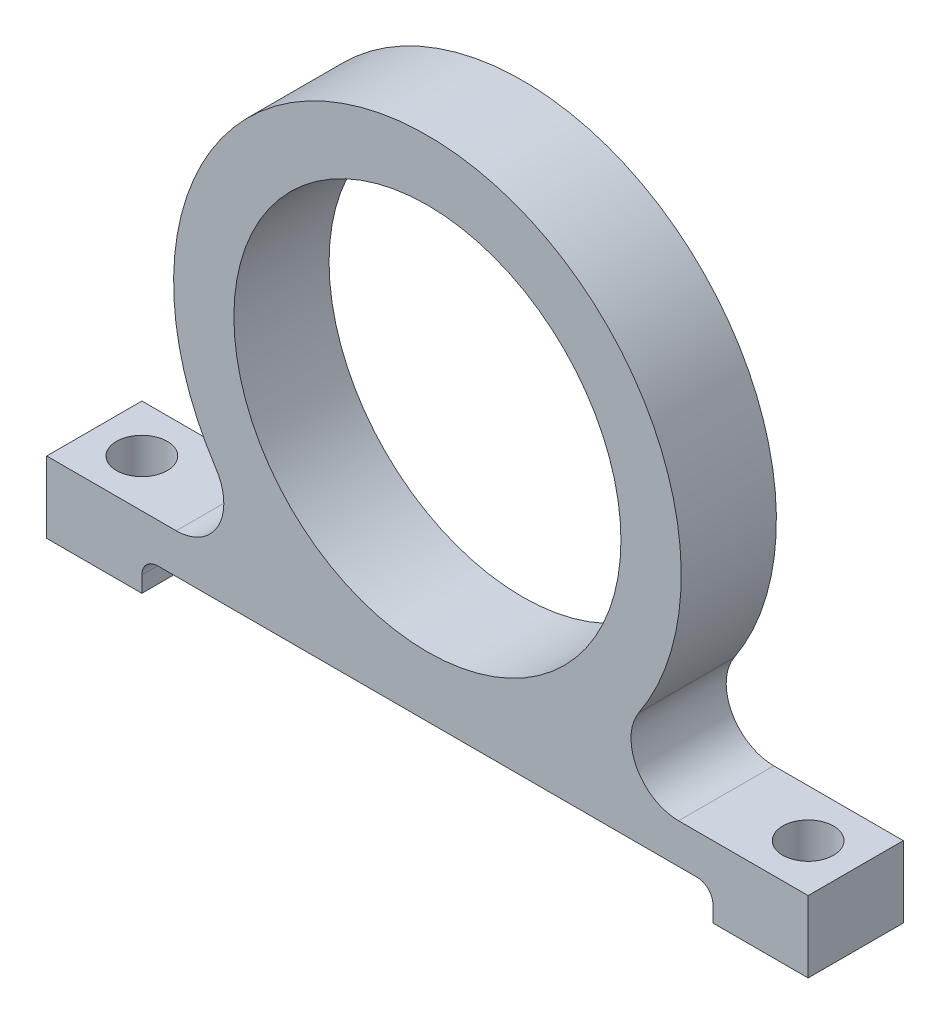
ISO-10303-21;
HEADER;
FILE_DESCRIPTION(('STEP AP214'),'2;1');
FILE_NAME('part.step','',(''),(''),'','','');
FILE_SCHEMA(('AUTOMOTIVE_DESIGN { 1 0 10303 214 1 1 1 1 }'));
ENDSEC;
DATA;
#1=APPLICATION_CONTEXT('core data for automotive mechanical design processes');
#2=APPLICATION_PROTOCOL_DEFINITION('international standard','automotive_design',2000,#1);
#3=PRODUCT_CONTEXT('',#1,'mechanical');
#4=PRODUCT('Part','Part','',(#3));
#5=PRODUCT_RELATED_PRODUCT_CATEGORY('part','',(#4));
#6=PRODUCT_DEFINITION_FORMATION('','',#4);
#7=PRODUCT_DEFINITION_CONTEXT('part definition',#1,'design');
#8=PRODUCT_DEFINITION('design','',#6,#7);
#9=PRODUCT_DEFINITION_SHAPE('','',#8);
#10=(LENGTH_UNIT() NAMED_UNIT(*) SI_UNIT(.MILLI.,.METRE.));
#11=(NAMED_UNIT(*) PLANE_ANGLE_UNIT() SI_UNIT($,.RADIAN.));
#12=(NAMED_UNIT(*) SI_UNIT($,.STERADIAN.) SOLID_ANGLE_UNIT());
#13=UNCERTAINTY_MEASURE_WITH_UNIT(LENGTH_MEASURE(1.E-05),#10,'distance_accuracy_value','');
#14=(GEOMETRIC_REPRESENTATION_CONTEXT(3) GLOBAL_UNCERTAINTY_ASSIGNED_CONTEXT((#13)) GLOBAL_UNIT_ASSIGNED_CONTEXT((#10,
#11,#12)) REPRESENTATION_CONTEXT('',''));
#15=CARTESIAN_POINT('',(0.,0.,0.));
#16=DIRECTION('',(0.,0.,1.));
#17=DIRECTION('',(1.,0.,0.));
#18=AXIS2_PLACEMENT_3D('',#15,#16,#17);
#19=CARTESIAN_POINT('',(0.,0.,5.99999999999991));
#20=DIRECTION('',(0.,0.,0.999999999999983));
#21=DIRECTION('',(1.,0.,0.));
#22=AXIS2_PLACEMENT_3D('',#19,#20,#21);
#23=PLANE('',#22);
#24=DIRECTION('',(0.,1.,0.));
#25=VECTOR('',#24,1.);
#26=CARTESIAN_POINT('',(-17.9999999999999,-15.9999999999998,5.99999999999989));
#27=LINE('',#26,#25);
#28=CARTESIAN_POINT('',(-17.9999999999999,-17.9999999999998,5.99999999999989));
#29=VERTEX_POINT('',#28);
#30=CARTESIAN_POINT('',(-17.9999999999999,-16.9999999999998,5.99999999999989));
#31=VERTEX_POINT('',#30);
#32=EDGE_CURVE('E229',#29,#31,#27,.T.);
#33=ORIENTED_EDGE('',*,*,#32,.T.);
#34=CARTESIAN_POINT('',(-16.9999999999999,-16.9999999999998,5.99999999999991));
#35=DIRECTION('',(0.,0.,0.999999999999983));
#36=DIRECTION('',(1.,0.,0.));
#37=AXIS2_PLACEMENT_3D('',#34,#35,#36);
#38=CIRCLE('',#37,1.);
#39=CARTESIAN_POINT('',(-16.9999999999999,-15.9999999999998,5.99999999999989));
#40=VERTEX_POINT('',#39);
#41=EDGE_CURVE('E11',#31,#40,#38,.F.);
#42=ORIENTED_EDGE('',*,*,#41,.T.);
#43=DIRECTION('',(1.,0.,0.));
#44=VECTOR('',#43,1.);
#45=CARTESIAN_POINT('',(18.0000000000001,-15.9999999999998,5.99999999999994));
#46=LINE('',#45,#44);
#47=CARTESIAN_POINT('',(17.0000000000001,-15.9999999999998,5.99999999999992));
#48=VERTEX_POINT('',#47);
#49=EDGE_CURVE('E154',#40,#48,#46,.T.);
#50=ORIENTED_EDGE('',*,*,#49,.T.);
#51=CARTESIAN_POINT('',(17.,-16.9999999999998,5.99999999999992));
#52=DIRECTION('',(0.,0.,0.999999999999983));
#53=DIRECTION('',(1.,0.,0.));
#54=AXIS2_PLACEMENT_3D('',#51,#52,#53);
#55=CIRCLE('',#54,1.);
#56=CARTESIAN_POINT('',(18.,-16.9999999999998,5.9999999999999));
#57=VERTEX_POINT('',#56);
#58=EDGE_CURVE('E149',#48,#57,#55,.F.);
#59=ORIENTED_EDGE('',*,*,#58,.T.);
#60=DIRECTION('',(0.,-1.,0.));
#61=VECTOR('',#60,1.);
#62=CARTESIAN_POINT('',(18.0000000000001,-15.9999999999998,5.99999999999994));
#63=LINE('',#62,#61);
#64=CARTESIAN_POINT('',(18.,-17.9999999999998,5.9999999999999));
#65=VERTEX_POINT('',#64);
#66=EDGE_CURVE('E141',#57,#65,#63,.T.);
#67=ORIENTED_EDGE('',*,*,#66,.T.);
#68=DIRECTION('',(1.,0.,0.));
#69=VECTOR('',#68,1.);
#70=CARTESIAN_POINT('',(18.,-17.9999999999998,5.9999999999999));
#71=LINE('',#70,#69);
#72=CARTESIAN_POINT('',(24.,-17.9999999999996,5.99999999999993));
#73=VERTEX_POINT('',#72);
#74=EDGE_CURVE('E145',#65,#73,#71,.T.);
#75=ORIENTED_EDGE('',*,*,#74,.T.);
#76=DIRECTION('',(0.,1.,0.));
#77=VECTOR('',#76,1.);
#78=CARTESIAN_POINT('',(24.,-17.9999999999996,5.99999999999993));
#79=LINE('',#78,#77);
#80=CARTESIAN_POINT('',(24.0000000000001,-13.4999999999998,5.99999999999991));
#81=VERTEX_POINT('',#80);
#82=EDGE_CURVE('E171',#73,#81,#79,.T.);
#83=ORIENTED_EDGE('',*,*,#82,.T.);
#84=DIRECTION('',(-1.,0.,0.));
#85=VECTOR('',#84,1.);
#86=CARTESIAN_POINT('',(8.58778201865894,-13.4999999999999,5.99999999999987));
#87=LINE('',#86,#85);
#88=CARTESIAN_POINT('',(15.8350876221132,-13.4999999999998,5.99999999999991));
#89=VERTEX_POINT('',#88);
#90=EDGE_CURVE('E175',#81,#89,#87,.T.);
#91=ORIENTED_EDGE('',*,*,#90,.T.);
#92=CARTESIAN_POINT('',(15.8350876221132,-10.5,5.99999999999991));
#93=DIRECTION('',(0.,0.,0.999999999999983));
#94=DIRECTION('',(1.,0.,0.));
#95=AXIS2_PLACEMENT_3D('',#92,#93,#94);
#96=CIRCLE('',#95,3.);
#97=CARTESIAN_POINT('',(13.334810629148,-8.84210526315791,5.99999999999991));
#98=VERTEX_POINT('',#97);
#99=EDGE_CURVE('E263',#89,#98,#96,.F.);
#100=ORIENTED_EDGE('',*,*,#99,.T.);
#101=CARTESIAN_POINT('',(0.,0.,5.99999999999991));
#102=DIRECTION('',(0.,0.,0.999999999999983));
#103=DIRECTION('',(1.,0.,0.));
#104=AXIS2_PLACEMENT_3D('',#101,#102,#103);
#105=CIRCLE('',#104,16.);
#106=CARTESIAN_POINT('',(-13.3348106291478,-8.84210526315749,5.99999999999989));
#107=VERTEX_POINT('',#106);
#108=EDGE_CURVE('E182',#98,#107,#105,.T.);
#109=ORIENTED_EDGE('',*,*,#108,.T.);
#110=CARTESIAN_POINT('',(-15.835087622113,-10.4999999999996,5.99999999999987));
#111=DIRECTION('',(0.,0.,0.999999999999983));
#112=DIRECTION('',(1.,0.,0.));
#113=AXIS2_PLACEMENT_3D('',#110,#111,#112);
#114=CIRCLE('',#113,3.);
#115=CARTESIAN_POINT('',(-15.835087622113,-13.5,5.99999999999987));
#116=VERTEX_POINT('',#115);
#117=EDGE_CURVE('E269',#107,#116,#114,.F.);
#118=ORIENTED_EDGE('',*,*,#117,.T.);
#119=DIRECTION('',(-1.,0.,0.));
#120=VECTOR('',#119,1.);
#121=CARTESIAN_POINT('',(-23.9999999999999,-13.5,5.99999999999991));
#122=LINE('',#121,#120);
#123=CARTESIAN_POINT('',(-23.9999999999999,-13.5,5.99999999999991));
#124=VERTEX_POINT('',#123);
#125=EDGE_CURVE('E186',#116,#124,#122,.T.);
#126=ORIENTED_EDGE('',*,*,#125,.T.);
#127=DIRECTION('',(0.,-1.,0.));
#128=VECTOR('',#127,1.);
#129=CARTESIAN_POINT('',(-23.9999999999999,-18.,5.99999999999993));
#130=LINE('',#129,#128);
#131=CARTESIAN_POINT('',(-23.9999999999999,-18.,5.99999999999993));
#132=VERTEX_POINT('',#131);
#133=EDGE_CURVE('E189',#124,#132,#130,.T.);
#134=ORIENTED_EDGE('',*,*,#133,.T.);
#135=DIRECTION('',(1.,0.,0.));
#136=VECTOR('',#135,1.);
#137=CARTESIAN_POINT('',(-17.9999999999999,-17.9999999999998,5.99999999999989));
#138=LINE('',#137,#136);
#139=EDGE_CURVE('E192',#132,#29,#138,.T.);
#140=ORIENTED_EDGE('',*,*,#139,.T.);
#141=EDGE_LOOP('',(#33,#42,#50,#59,#67,#75,#83,#91,#100,#109,#118,#126,#134,#140));
#142=FACE_BOUND('',#141,.T.);
#143=CARTESIAN_POINT('',(0.,0.,5.99999999999991));
#144=DIRECTION('',(0.,0.,0.999999999999983));
#145=DIRECTION('',(1.,0.,0.));
#146=AXIS2_PLACEMENT_3D('',#143,#144,#145);
#147=CIRCLE('',#146,12.2);
#148=CARTESIAN_POINT('',(12.2000000000001,0.,5.99999999999991));
#149=VERTEX_POINT('',#148);
#150=EDGE_CURVE('E200',#149,#149,#147,.T.);
#151=ORIENTED_EDGE('',*,*,#150,.F.);
#152=EDGE_LOOP('',(#151));
#153=FACE_BOUND('',#152,.T.);
#154=ADVANCED_FACE('F40',(#142,#153),#23,.T.);
#155=CARTESIAN_POINT('',(0.,0.,0.));
#156=DIRECTION('',(0.,0.,0.999999999999983));
#157=DIRECTION('',(1.,0.,0.));
#158=AXIS2_PLACEMENT_3D('',#155,#156,#157);
#159=PLANE('',#158);
#160=DIRECTION('',(0.,1.,0.));
#161=VECTOR('',#160,1.);
#162=CARTESIAN_POINT('',(-17.9999999999999,-15.9999999999998,0.));
#163=LINE('',#162,#161);
#164=CARTESIAN_POINT('',(-17.9999999999999,-17.9999999999998,0.));
#165=VERTEX_POINT('',#164);
#166=CARTESIAN_POINT('',(-17.9999999999999,-16.9999999999998,0.));
#167=VERTEX_POINT('',#166);
#168=EDGE_CURVE('E196',#165,#167,#163,.T.);
#169=ORIENTED_EDGE('',*,*,#168,.F.);
#170=DIRECTION('',(1.,0.,0.));
#171=VECTOR('',#170,1.);
#172=CARTESIAN_POINT('',(-17.9999999999999,-17.9999999999998,0.));
#173=LINE('',#172,#171);
#174=CARTESIAN_POINT('',(-23.9999999999999,-18.,0.));
#175=VERTEX_POINT('',#174);
#176=EDGE_CURVE('E226',#175,#165,#173,.T.);
#177=ORIENTED_EDGE('',*,*,#176,.F.);
#178=DIRECTION('',(0.,-1.,0.));
#179=VECTOR('',#178,1.);
#180=CARTESIAN_POINT('',(-23.9999999999999,-18.,0.));
#181=LINE('',#180,#179);
#182=CARTESIAN_POINT('',(-23.9999999999999,-13.4999999999999,0.));
#183=VERTEX_POINT('',#182);
#184=EDGE_CURVE('E223',#183,#175,#181,.T.);
#185=ORIENTED_EDGE('',*,*,#184,.F.);
#186=DIRECTION('',(-1.,0.,0.));
#187=VECTOR('',#186,1.);
#188=CARTESIAN_POINT('',(-23.9999999999999,-13.4999999999999,0.));
#189=LINE('',#188,#187);
#190=CARTESIAN_POINT('',(-15.835087622113,-13.4999999999999,0.));
#191=VERTEX_POINT('',#190);
#192=EDGE_CURVE('E220',#191,#183,#189,.T.);
#193=ORIENTED_EDGE('',*,*,#192,.F.);
#194=CARTESIAN_POINT('',(-15.835087622113,-10.4999999999996,0.));
#195=DIRECTION('',(0.,0.,0.999999999999983));
#196=DIRECTION('',(1.,0.,0.));
#197=AXIS2_PLACEMENT_3D('',#194,#195,#196);
#198=CIRCLE('',#197,3.);
#199=CARTESIAN_POINT('',(-13.3348106291478,-8.84210526315749,0.));
#200=VERTEX_POINT('',#199);
#201=EDGE_CURVE('E266',#191,#200,#198,.T.);
#202=ORIENTED_EDGE('',*,*,#201,.T.);
#203=CARTESIAN_POINT('',(0.,0.,0.));
#204=DIRECTION('',(0.,0.,0.999999999999983));
#205=DIRECTION('',(1.,0.,0.));
#206=AXIS2_PLACEMENT_3D('',#203,#204,#205);
#207=CIRCLE('',#206,16.);
#208=CARTESIAN_POINT('',(13.3348106291479,-8.84210526315791,0.));
#209=VERTEX_POINT('',#208);
#210=EDGE_CURVE('E216',#209,#200,#207,.T.);
#211=ORIENTED_EDGE('',*,*,#210,.F.);
#212=CARTESIAN_POINT('',(15.8350876221131,-10.5,0.));
#213=DIRECTION('',(0.,0.,0.999999999999983));
#214=DIRECTION('',(1.,0.,0.));
#215=AXIS2_PLACEMENT_3D('',#212,#213,#214);
#216=CIRCLE('',#215,3.);
#217=CARTESIAN_POINT('',(15.8350876221131,-13.4999999999998,0.));
#218=VERTEX_POINT('',#217);
#219=EDGE_CURVE('E260',#209,#218,#216,.T.);
#220=ORIENTED_EDGE('',*,*,#219,.T.);
#221=DIRECTION('',(-1.,0.,0.));
#222=VECTOR('',#221,1.);
#223=CARTESIAN_POINT('',(8.58778201865884,-13.4999999999998,0.));
#224=LINE('',#223,#222);
#225=CARTESIAN_POINT('',(24.,-13.4999999999998,0.));
#226=VERTEX_POINT('',#225);
#227=EDGE_CURVE('E212',#226,#218,#224,.T.);
#228=ORIENTED_EDGE('',*,*,#227,.F.);
#229=DIRECTION('',(0.,1.,0.));
#230=VECTOR('',#229,1.);
#231=CARTESIAN_POINT('',(24.0000000000001,-17.9999999999996,0.));
#232=LINE('',#231,#230);
#233=CARTESIAN_POINT('',(24.0000000000001,-17.9999999999996,0.));
#234=VERTEX_POINT('',#233);
#235=EDGE_CURVE('E209',#234,#226,#232,.T.);
#236=ORIENTED_EDGE('',*,*,#235,.F.);
#237=DIRECTION('',(1.,0.,0.));
#238=VECTOR('',#237,1.);
#239=CARTESIAN_POINT('',(18.0000000000001,-17.9999999999998,0.));
#240=LINE('',#239,#238);
#241=CARTESIAN_POINT('',(18.0000000000001,-17.9999999999998,0.));
#242=VERTEX_POINT('',#241);
#243=EDGE_CURVE('E206',#242,#234,#240,.T.);
#244=ORIENTED_EDGE('',*,*,#243,.F.);
#245=DIRECTION('',(0.,-1.,0.));
#246=VECTOR('',#245,1.);
#247=CARTESIAN_POINT('',(18.0000000000001,-15.9999999999998,0.));
#248=LINE('',#247,#246);
#249=CARTESIAN_POINT('',(18.0000000000001,-16.9999999999998,0.));
#250=VERTEX_POINT('',#249);
#251=EDGE_CURVE('E160',#250,#242,#248,.T.);
#252=ORIENTED_EDGE('',*,*,#251,.F.);
#253=CARTESIAN_POINT('',(17.0000000000001,-16.9999999999998,0.));
#254=DIRECTION('',(0.,0.,0.999999999999983));
#255=DIRECTION('',(1.,0.,0.));
#256=AXIS2_PLACEMENT_3D('',#253,#254,#255);
#257=CIRCLE('',#256,1.);
#258=CARTESIAN_POINT('',(17.0000000000001,-15.9999999999998,0.));
#259=VERTEX_POINT('',#258);
#260=EDGE_CURVE('E284',#250,#259,#257,.T.);
#261=ORIENTED_EDGE('',*,*,#260,.T.);
#262=DIRECTION('',(1.,0.,0.));
#263=VECTOR('',#262,1.);
#264=CARTESIAN_POINT('',(18.0000000000001,-15.9999999999998,0.));
#265=LINE('',#264,#263);
#266=CARTESIAN_POINT('',(-16.9999999999999,-15.9999999999998,0.));
#267=VERTEX_POINT('',#266);
#268=EDGE_CURVE('E199',#267,#259,#265,.T.);
#269=ORIENTED_EDGE('',*,*,#268,.F.);
#270=CARTESIAN_POINT('',(-16.9999999999999,-16.9999999999998,0.));
#271=DIRECTION('',(0.,0.,0.999999999999983));
#272=DIRECTION('',(1.,0.,0.));
#273=AXIS2_PLACEMENT_3D('',#270,#271,#272);
#274=CIRCLE('',#273,1.);
#275=EDGE_CURVE('E49',#267,#167,#274,.T.);
#276=ORIENTED_EDGE('',*,*,#275,.T.);
#277=EDGE_LOOP('',(#169,#177,#185,#193,#202,#211,#220,#228,#236,#244,#252,#261,#269,#276));
#278=FACE_BOUND('',#277,.T.);
#279=CARTESIAN_POINT('',(0.,0.,0.));
#280=DIRECTION('',(0.,0.,0.999999999999983));
#281=DIRECTION('',(1.,0.,0.));
#282=AXIS2_PLACEMENT_3D('',#279,#280,#281);
#283=CIRCLE('',#282,12.2);
#284=CARTESIAN_POINT('',(12.2,0.,0.));
#285=VERTEX_POINT('',#284);
#286=EDGE_CURVE('E413',#285,#285,#283,.T.);
#287=ORIENTED_EDGE('',*,*,#286,.T.);
#288=EDGE_LOOP('',(#287));
#289=FACE_BOUND('',#288,.T.);
#290=ADVANCED_FACE('F317',(#278,#289),#159,.F.);
#291=CARTESIAN_POINT('',(-17.9999999999999,-15.9999999999998,5.99999999999989));
#292=DIRECTION('',(-1.,0.,0.));
#293=DIRECTION('',(0.,-1.,0.));
#294=AXIS2_PLACEMENT_3D('',#291,#292,#293);
#295=PLANE('',#294);
#296=ORIENTED_EDGE('',*,*,#168,.T.);
#297=DIRECTION('',(0.,0.,-0.999999999999983));
#298=VECTOR('',#297,1.);
#299=CARTESIAN_POINT('',(-17.9999999999999,-16.9999999999998,5.99999999999989));
#300=LINE('',#299,#298);
#301=EDGE_CURVE('E56',#167,#31,#300,.F.);
#302=ORIENTED_EDGE('',*,*,#301,.T.);
#303=ORIENTED_EDGE('',*,*,#32,.F.);
#304=DIRECTION('',(0.,0.,-0.999999999999983));
#305=VECTOR('',#304,1.);
#306=CARTESIAN_POINT('',(-17.9999999999999,-17.9999999999998,5.99999999999989));
#307=LINE('',#306,#305);
#308=EDGE_CURVE('E195',#29,#165,#307,.T.);
#309=ORIENTED_EDGE('',*,*,#308,.T.);
#310=EDGE_LOOP('',(#296,#302,#303,#309));
#311=FACE_BOUND('',#310,.T.);
#312=ADVANCED_FACE('F342',(#311),#295,.F.);
#313=CARTESIAN_POINT('',(18.0000000000001,-15.9999999999998,5.99999999999994));
#314=DIRECTION('',(0.,1.,0.));
#315=DIRECTION('',(0.,0.,0.999999999999983));
#316=AXIS2_PLACEMENT_3D('',#313,#314,#315);
#317=PLANE('',#316);
#318=ORIENTED_EDGE('',*,*,#268,.T.);
#319=DIRECTION('',(0.,0.,-0.999999999999983));
#320=VECTOR('',#319,1.);
#321=CARTESIAN_POINT('',(17.0000000000001,-15.9999999999998,5.99999999999992));
#322=LINE('',#321,#320);
#323=EDGE_CURVE('E279',#259,#48,#322,.F.);
#324=ORIENTED_EDGE('',*,*,#323,.T.);
#325=ORIENTED_EDGE('',*,*,#49,.F.);
#326=DIRECTION('',(0.,0.,-0.999999999999983));
#327=VECTOR('',#326,1.);
#328=CARTESIAN_POINT('',(-16.9999999999999,-15.9999999999998,0.));
#329=LINE('',#328,#327);
#330=EDGE_CURVE('E275',#40,#267,#329,.T.);
#331=ORIENTED_EDGE('',*,*,#330,.T.);
#332=EDGE_LOOP('',(#318,#324,#325,#331));
#333=FACE_BOUND('',#332,.T.);
#334=ADVANCED_FACE('F322',(#333),#317,.F.);
#335=CARTESIAN_POINT('',(18.0000000000001,-15.9999999999998,5.99999999999994));
#336=DIRECTION('',(1.,0.,0.));
#337=DIRECTION('',(0.,1.,0.));
#338=AXIS2_PLACEMENT_3D('',#335,#336,#337);
#339=PLANE('',#338);
#340=ORIENTED_EDGE('',*,*,#66,.F.);
#341=DIRECTION('',(0.,0.,-0.999999999999983));
#342=VECTOR('',#341,1.);
#343=CARTESIAN_POINT('',(18.0000000000001,-16.9999999999998,0.));
#344=LINE('',#343,#342);
#345=EDGE_CURVE('E272',#57,#250,#344,.T.);
#346=ORIENTED_EDGE('',*,*,#345,.T.);
#347=ORIENTED_EDGE('',*,*,#251,.T.);
#348=DIRECTION('',(0.,0.,-0.999999999999983));
#349=VECTOR('',#348,1.);
#350=CARTESIAN_POINT('',(18.,-17.9999999999998,5.9999999999999));
#351=LINE('',#350,#349);
#352=EDGE_CURVE('E157',#65,#242,#351,.T.);
#353=ORIENTED_EDGE('',*,*,#352,.F.);
#354=EDGE_LOOP('',(#340,#346,#347,#353));
#355=FACE_BOUND('',#354,.T.);
#356=ADVANCED_FACE('F158',(#355),#339,.F.);
#357=CARTESIAN_POINT('',(18.,-17.9999999999998,5.9999999999999));
#358=DIRECTION('',(0.,1.,0.));
#359=DIRECTION('',(0.,0.,0.999999999999983));
#360=AXIS2_PLACEMENT_3D('',#357,#358,#359);
#361=PLANE('',#360);
#362=CARTESIAN_POINT('',(21.0000000000001,-17.9999999999998,3.00000000000002));
#363=DIRECTION('',(0.,1.,0.));
#364=DIRECTION('',(0.,0.,0.999999999999983));
#365=AXIS2_PLACEMENT_3D('',#362,#363,#364);
#366=CIRCLE('',#365,1.6);
#367=CARTESIAN_POINT('',(21.0000000000001,-17.9999999999998,4.59999999999999));
#368=VERTEX_POINT('',#367);
#369=EDGE_CURVE('E417',#368,#368,#366,.T.);
#370=ORIENTED_EDGE('',*,*,#369,.T.);
#371=EDGE_LOOP('',(#370));
#372=FACE_BOUND('',#371,.T.);
#373=ORIENTED_EDGE('',*,*,#243,.T.);
#374=DIRECTION('',(0.,0.,-0.999999999999983));
#375=VECTOR('',#374,1.);
#376=CARTESIAN_POINT('',(24.,-17.9999999999996,5.99999999999993));
#377=LINE('',#376,#375);
#378=EDGE_CURVE('E165',#73,#234,#377,.T.);
#379=ORIENTED_EDGE('',*,*,#378,.F.);
#380=ORIENTED_EDGE('',*,*,#74,.F.);
#381=ORIENTED_EDGE('',*,*,#352,.T.);
#382=EDGE_LOOP('',(#373,#379,#380,#381));
#383=FACE_BOUND('',#382,.T.);
#384=ADVANCED_FACE('F167',(#372,#383),#361,.F.);
#385=CARTESIAN_POINT('',(24.,-17.9999999999996,5.99999999999993));
#386=DIRECTION('',(-1.,0.,0.));
#387=DIRECTION('',(0.,0.,0.999999999999983));
#388=AXIS2_PLACEMENT_3D('',#385,#386,#387);
#389=PLANE('',#388);
#390=ORIENTED_EDGE('',*,*,#235,.T.);
#391=DIRECTION('',(0.,0.,-0.999999999999983));
#392=VECTOR('',#391,1.);
#393=CARTESIAN_POINT('',(24.0000000000001,-13.4999999999998,5.99999999999991));
#394=LINE('',#393,#392);
#395=EDGE_CURVE('E241',#81,#226,#394,.T.);
#396=ORIENTED_EDGE('',*,*,#395,.F.);
#397=ORIENTED_EDGE('',*,*,#82,.F.);
#398=ORIENTED_EDGE('',*,*,#378,.T.);
#399=EDGE_LOOP('',(#390,#396,#397,#398));
#400=FACE_BOUND('',#399,.T.);
#401=ADVANCED_FACE('F367',(#400),#389,.F.);
#402=CARTESIAN_POINT('',(8.58778201865894,-13.4999999999999,5.99999999999987));
#403=DIRECTION('',(0.,-1.,0.));
#404=DIRECTION('',(0.,0.,-0.999999999999983));
#405=AXIS2_PLACEMENT_3D('',#402,#403,#404);
#406=PLANE('',#405);
#407=CARTESIAN_POINT('',(21.,-13.4999999999998,3.));
#408=DIRECTION('',(0.,1.,0.));
#409=DIRECTION('',(0.,0.,0.999999999999983));
#410=AXIS2_PLACEMENT_3D('',#407,#408,#409);
#411=CIRCLE('',#410,1.6);
#412=CARTESIAN_POINT('',(21.,-13.4999999999998,4.59999999999997));
#413=VERTEX_POINT('',#412);
#414=EDGE_CURVE('E424',#413,#413,#411,.T.);
#415=ORIENTED_EDGE('',*,*,#414,.F.);
#416=EDGE_LOOP('',(#415));
#417=FACE_BOUND('',#416,.T.);
#418=ORIENTED_EDGE('',*,*,#227,.T.);
#419=DIRECTION('',(0.,0.,0.999999999999983));
#420=VECTOR('',#419,1.);
#421=CARTESIAN_POINT('',(15.8350876221132,-13.4999999999998,5.99999999999991));
#422=LINE('',#421,#420);
#423=EDGE_CURVE('E253',#218,#89,#422,.T.);
#424=ORIENTED_EDGE('',*,*,#423,.T.);
#425=ORIENTED_EDGE('',*,*,#90,.F.);
#426=ORIENTED_EDGE('',*,*,#395,.T.);
#427=EDGE_LOOP('',(#418,#424,#425,#426));
#428=FACE_BOUND('',#427,.T.);
#429=ADVANCED_FACE('F363',(#417,#428),#406,.F.);
#430=CARTESIAN_POINT('',(0.,0.,5.99999999999991));
#431=DIRECTION('',(0.,0.,-0.999999999999983));
#432=DIRECTION('',(-1.,0.,0.));
#433=AXIS2_PLACEMENT_3D('',#430,#431,#432);
#434=CYLINDRICAL_SURFACE('',#433,16.);
#435=ORIENTED_EDGE('',*,*,#108,.F.);
#436=DIRECTION('',(0.,0.,-0.999999999999983));
#437=VECTOR('',#436,1.);
#438=CARTESIAN_POINT('',(13.334810629148,-8.84210526315791,5.99999999999991));
#439=LINE('',#438,#437);
#440=EDGE_CURVE('E249',#98,#209,#439,.T.);
#441=ORIENTED_EDGE('',*,*,#440,.T.);
#442=ORIENTED_EDGE('',*,*,#210,.T.);
#443=DIRECTION('',(0.,0.,-0.999999999999983));
#444=VECTOR('',#443,1.);
#445=CARTESIAN_POINT('',(-13.3348106291478,-8.84210526315749,5.99999999999989));
#446=LINE('',#445,#444);
#447=EDGE_CURVE('E164',#200,#107,#446,.F.);
#448=ORIENTED_EDGE('',*,*,#447,.T.);
#449=EDGE_LOOP('',(#435,#441,#442,#448));
#450=FACE_BOUND('',#449,.T.);
#451=ADVANCED_FACE('F359',(#450),#434,.T.);
#452=CARTESIAN_POINT('',(-23.9999999999999,-13.5,5.99999999999991));
#453=DIRECTION('',(0.,-1.,0.));
#454=DIRECTION('',(0.,0.,-0.999999999999983));
#455=AXIS2_PLACEMENT_3D('',#452,#453,#454);
#456=PLANE('',#455);
#457=CARTESIAN_POINT('',(-21.,-13.4999999999999,3.));
#458=DIRECTION('',(0.,1.,0.));
#459=DIRECTION('',(0.,0.,0.999999999999983));
#460=AXIS2_PLACEMENT_3D('',#457,#458,#459);
#461=CIRCLE('',#460,1.6);
#462=CARTESIAN_POINT('',(-21.,-13.4999999999999,4.59999999999997));
#463=VERTEX_POINT('',#462);
#464=EDGE_CURVE('E432',#463,#463,#461,.T.);
#465=ORIENTED_EDGE('',*,*,#464,.F.);
#466=EDGE_LOOP('',(#465));
#467=FACE_BOUND('',#466,.T.);
#468=ORIENTED_EDGE('',*,*,#125,.F.);
#469=DIRECTION('',(0.,0.,0.999999999999983));
#470=VECTOR('',#469,1.);
#471=CARTESIAN_POINT('',(-15.835087622113,-13.4999999999999,0.));
#472=LINE('',#471,#470);
#473=EDGE_CURVE('E256',#116,#191,#472,.F.);
#474=ORIENTED_EDGE('',*,*,#473,.T.);
#475=ORIENTED_EDGE('',*,*,#192,.T.);
#476=DIRECTION('',(0.,0.,-0.999999999999983));
#477=VECTOR('',#476,1.);
#478=CARTESIAN_POINT('',(-23.9999999999999,-13.5,5.99999999999991));
#479=LINE('',#478,#477);
#480=EDGE_CURVE('E237',#124,#183,#479,.T.);
#481=ORIENTED_EDGE('',*,*,#480,.F.);
#482=EDGE_LOOP('',(#468,#474,#475,#481));
#483=FACE_BOUND('',#482,.T.);
#484=ADVANCED_FACE('F355',(#467,#483),#456,.F.);
#485=CARTESIAN_POINT('',(-23.9999999999999,-18.,5.99999999999993));
#486=DIRECTION('',(1.,0.,0.));
#487=DIRECTION('',(0.,0.,-0.999999999999983));
#488=AXIS2_PLACEMENT_3D('',#485,#486,#487);
#489=PLANE('',#488);
#490=ORIENTED_EDGE('',*,*,#184,.T.);
#491=DIRECTION('',(0.,0.,-0.999999999999983));
#492=VECTOR('',#491,1.);
#493=CARTESIAN_POINT('',(-23.9999999999999,-18.,5.99999999999993));
#494=LINE('',#493,#492);
#495=EDGE_CURVE('E233',#132,#175,#494,.T.);
#496=ORIENTED_EDGE('',*,*,#495,.F.);
#497=ORIENTED_EDGE('',*,*,#133,.F.);
#498=ORIENTED_EDGE('',*,*,#480,.T.);
#499=EDGE_LOOP('',(#490,#496,#497,#498));
#500=FACE_BOUND('',#499,.T.);
#501=ADVANCED_FACE('F351',(#500),#489,.F.);
#502=CARTESIAN_POINT('',(-17.9999999999999,-17.9999999999998,5.99999999999989));
#503=DIRECTION('',(0.,1.,0.));
#504=DIRECTION('',(0.,0.,0.999999999999983));
#505=AXIS2_PLACEMENT_3D('',#502,#503,#504);
#506=PLANE('',#505);
#507=CARTESIAN_POINT('',(-21.,-17.9999999999998,3.00000000000001));
#508=DIRECTION('',(0.,1.,0.));
#509=DIRECTION('',(0.,0.,0.999999999999983));
#510=AXIS2_PLACEMENT_3D('',#507,#508,#509);
#511=CIRCLE('',#510,1.6);
#512=CARTESIAN_POINT('',(-21.,-17.9999999999998,4.59999999999999));
#513=VERTEX_POINT('',#512);
#514=EDGE_CURVE('E428',#513,#513,#511,.T.);
#515=ORIENTED_EDGE('',*,*,#514,.T.);
#516=EDGE_LOOP('',(#515));
#517=FACE_BOUND('',#516,.T.);
#518=ORIENTED_EDGE('',*,*,#176,.T.);
#519=ORIENTED_EDGE('',*,*,#308,.F.);
#520=ORIENTED_EDGE('',*,*,#139,.F.);
#521=ORIENTED_EDGE('',*,*,#495,.T.);
#522=EDGE_LOOP('',(#518,#519,#520,#521));
#523=FACE_BOUND('',#522,.T.);
#524=ADVANCED_FACE('F348',(#517,#523),#506,.F.);
#525=CARTESIAN_POINT('',(0.,0.,5.99999999999991));
#526=DIRECTION('',(0.,0.,-0.999999999999983));
#527=DIRECTION('',(-1.,0.,0.));
#528=AXIS2_PLACEMENT_3D('',#525,#526,#527);
#529=CYLINDRICAL_SURFACE('',#528,12.2);
#530=ORIENTED_EDGE('',*,*,#150,.T.);
#531=EDGE_LOOP('',(#530));
#532=FACE_BOUND('',#531,.T.);
#533=ORIENTED_EDGE('',*,*,#286,.F.);
#534=EDGE_LOOP('',(#533));
#535=FACE_BOUND('',#534,.T.);
#536=ADVANCED_FACE('F345',(#532,#535),#529,.F.);
#537=CARTESIAN_POINT('',(15.8350876221132,-10.5,5.99999999999991));
#538=DIRECTION('',(0.,0.,-0.999999999999983));
#539=DIRECTION('',(-1.,0.,0.));
#540=AXIS2_PLACEMENT_3D('',#537,#538,#539);
#541=CYLINDRICAL_SURFACE('',#540,3.);
#542=ORIENTED_EDGE('',*,*,#99,.F.);
#543=ORIENTED_EDGE('',*,*,#423,.F.);
#544=ORIENTED_EDGE('',*,*,#219,.F.);
#545=ORIENTED_EDGE('',*,*,#440,.F.);
#546=EDGE_LOOP('',(#542,#543,#544,#545));
#547=FACE_BOUND('',#546,.T.);
#548=ADVANCED_FACE('F334',(#547),#541,.F.);
#549=CARTESIAN_POINT('',(-15.835087622113,-10.4999999999996,5.99999999999987));
#550=DIRECTION('',(0.,0.,-0.999999999999983));
#551=DIRECTION('',(-1.,0.,0.));
#552=AXIS2_PLACEMENT_3D('',#549,#550,#551);
#553=CYLINDRICAL_SURFACE('',#552,3.);
#554=ORIENTED_EDGE('',*,*,#117,.F.);
#555=ORIENTED_EDGE('',*,*,#447,.F.);
#556=ORIENTED_EDGE('',*,*,#201,.F.);
#557=ORIENTED_EDGE('',*,*,#473,.F.);
#558=EDGE_LOOP('',(#554,#555,#556,#557));
#559=FACE_BOUND('',#558,.T.);
#560=ADVANCED_FACE('F327',(#559),#553,.F.);
#561=CARTESIAN_POINT('',(17.,-16.9999999999998,5.99999999999992));
#562=DIRECTION('',(0.,0.,0.999999999999983));
#563=DIRECTION('',(1.,0.,0.));
#564=AXIS2_PLACEMENT_3D('',#561,#562,#563);
#565=CYLINDRICAL_SURFACE('',#564,1.);
#566=ORIENTED_EDGE('',*,*,#58,.F.);
#567=ORIENTED_EDGE('',*,*,#323,.F.);
#568=ORIENTED_EDGE('',*,*,#260,.F.);
#569=ORIENTED_EDGE('',*,*,#345,.F.);
#570=EDGE_LOOP('',(#566,#567,#568,#569));
#571=FACE_BOUND('',#570,.T.);
#572=ADVANCED_FACE('F325',(#571),#565,.F.);
#573=CARTESIAN_POINT('',(-16.9999999999999,-16.9999999999998,5.99999999999991));
#574=DIRECTION('',(0.,0.,0.999999999999983));
#575=DIRECTION('',(1.,0.,0.));
#576=AXIS2_PLACEMENT_3D('',#573,#574,#575);
#577=CYLINDRICAL_SURFACE('',#576,1.);
#578=ORIENTED_EDGE('',*,*,#41,.F.);
#579=ORIENTED_EDGE('',*,*,#301,.F.);
#580=ORIENTED_EDGE('',*,*,#275,.F.);
#581=ORIENTED_EDGE('',*,*,#330,.F.);
#582=EDGE_LOOP('',(#578,#579,#580,#581));
#583=FACE_BOUND('',#582,.T.);
#584=ADVANCED_FACE('F42',(#583),#577,.F.);
#585=CARTESIAN_POINT('',(21.,-13.4999999999998,3.));
#586=DIRECTION('',(0.,1.,0.));
#587=DIRECTION('',(0.,0.,0.999999999999983));
#588=AXIS2_PLACEMENT_3D('',#585,#586,#587);
#589=CYLINDRICAL_SURFACE('',#588,1.6);
#590=ORIENTED_EDGE('',*,*,#369,.F.);
#591=EDGE_LOOP('',(#590));
#592=FACE_BOUND('',#591,.T.);
#593=ORIENTED_EDGE('',*,*,#414,.T.);
#594=EDGE_LOOP('',(#593));
#595=FACE_BOUND('',#594,.T.);
#596=ADVANCED_FACE('F332',(#592,#595),#589,.F.);
#597=CARTESIAN_POINT('',(-21.,-13.4999999999999,3.));
#598=DIRECTION('',(0.,1.,0.));
#599=DIRECTION('',(0.,0.,0.999999999999983));
#600=AXIS2_PLACEMENT_3D('',#597,#598,#599);
#601=CYLINDRICAL_SURFACE('',#600,1.6);
#602=ORIENTED_EDGE('',*,*,#514,.F.);
#603=EDGE_LOOP('',(#602));
#604=FACE_BOUND('',#603,.T.);
#605=ORIENTED_EDGE('',*,*,#464,.T.);
#606=EDGE_LOOP('',(#605));
#607=FACE_BOUND('',#606,.T.);
#608=ADVANCED_FACE('F438',(#604,#607),#601,.F.);
#609=CLOSED_SHELL('',(#154,#290,#312,#334,#356,#384,#401,#429,#451,#484,#501,#524,#536,#548,
#560,#572,#584,#596,#608));
#610=MANIFOLD_SOLID_BREP('B2',#609);
#611=ADVANCED_BREP_SHAPE_REPRESENTATION('',(#18,#610),#14);
#612=SHAPE_DEFINITION_REPRESENTATION(#9,#611);
ENDSEC;
END-ISO-10303-21;
